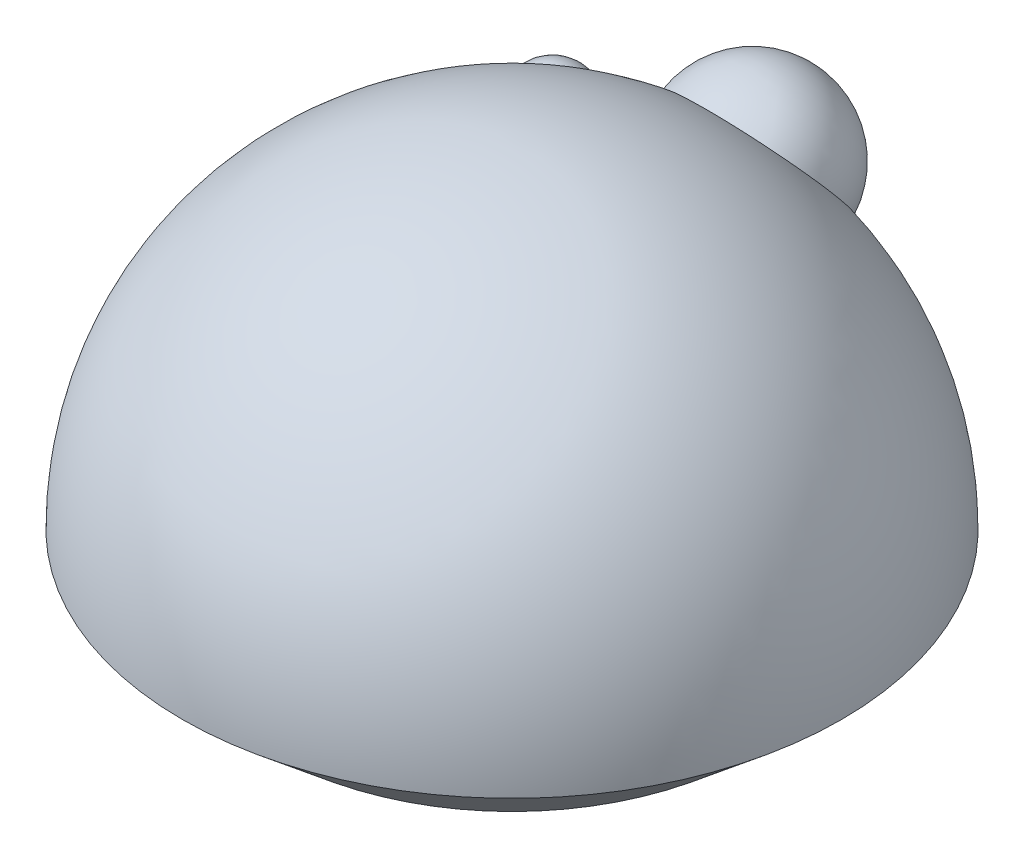
ISO-10303-21;
HEADER;
FILE_DESCRIPTION(('STEP AP214'),'2;1');
FILE_NAME('part.step','',(''),(''),'','','');
FILE_SCHEMA(('AUTOMOTIVE_DESIGN { 1 0 10303 214 1 1 1 1 }'));
ENDSEC;
DATA;
#1=APPLICATION_CONTEXT('core data for automotive mechanical design processes');
#2=APPLICATION_PROTOCOL_DEFINITION('international standard','automotive_design',2000,#1);
#3=PRODUCT_CONTEXT('',#1,'mechanical');
#4=PRODUCT('Part','Part','',(#3));
#5=PRODUCT_RELATED_PRODUCT_CATEGORY('part','',(#4));
#6=PRODUCT_DEFINITION_FORMATION('','',#4);
#7=PRODUCT_DEFINITION_CONTEXT('part definition',#1,'design');
#8=PRODUCT_DEFINITION('design','',#6,#7);
#9=PRODUCT_DEFINITION_SHAPE('','',#8);
#10=(LENGTH_UNIT() NAMED_UNIT(*) SI_UNIT(.MILLI.,.METRE.));
#11=(NAMED_UNIT(*) PLANE_ANGLE_UNIT() SI_UNIT($,.RADIAN.));
#12=(NAMED_UNIT(*) SI_UNIT($,.STERADIAN.) SOLID_ANGLE_UNIT());
#13=UNCERTAINTY_MEASURE_WITH_UNIT(LENGTH_MEASURE(1.E-05),#10,'distance_accuracy_value','');
#14=(GEOMETRIC_REPRESENTATION_CONTEXT(3) GLOBAL_UNCERTAINTY_ASSIGNED_CONTEXT((#13)) GLOBAL_UNIT_ASSIGNED_CONTEXT((#10,
#11,#12)) REPRESENTATION_CONTEXT('',''));
#15=CARTESIAN_POINT('',(0.,0.,0.));
#16=DIRECTION('',(0.,0.,1.));
#17=DIRECTION('',(1.,0.,0.));
#18=AXIS2_PLACEMENT_3D('',#15,#16,#17);
#19=CARTESIAN_POINT('',(0.,129.232052778404,0.));
#20=DIRECTION('',(0.,1.,0.));
#21=DIRECTION('',(1.,0.,0.));
#22=AXIS2_PLACEMENT_3D('',#19,#20,#21);
#23=SPHERICAL_SURFACE('',#22,75.);
#24=CARTESIAN_POINT('',(0.,175.508636051353,-56.0737410143181));
#25=DIRECTION('',(0.,0.636511821434824,-0.771266945469416));
#26=DIRECTION('',(0.,0.771266945469416,0.636511821434824));
#27=AXIS2_PLACEMENT_3D('',#24,#25,#26);
#28=CIRCLE('',#27,18.4177471271879);
#29=CARTESIAN_POINT('',(0.,189.713635620567,-44.3506272436657));
#30=VERTEX_POINT('',#29);
#31=EDGE_CURVE('E42',#30,#30,#28,.F.);
#32=ORIENTED_EDGE('',*,*,#31,.T.);
#33=EDGE_LOOP('',(#32));
#34=FACE_BOUND('',#33,.T.);
#35=CARTESIAN_POINT('',(0.,129.232052778404,0.));
#36=DIRECTION('',(0.,1.,0.));
#37=DIRECTION('',(0.,0.,1.));
#38=AXIS2_PLACEMENT_3D('',#35,#36,#37);
#39=CIRCLE('',#38,75.);
#40=CARTESIAN_POINT('',(0.,129.232052778404,75.));
#41=VERTEX_POINT('',#40);
#42=EDGE_CURVE('E10',#41,#41,#39,.T.);
#43=ORIENTED_EDGE('',*,*,#42,.T.);
#44=EDGE_LOOP('',(#43));
#45=FACE_BOUND('',#44,.T.);
#46=CARTESIAN_POINT('',(-44.1879325612681,157.769587064264,-52.7400854962121));
#47=DIRECTION('',(0.593221163318381,-0.38311521508329,0.708033462036133));
#48=DIRECTION('',(0.766518382271403,0.,-0.642222367751257));
#49=AXIS2_PLACEMENT_3D('',#46,#47,#48);
#50=CIRCLE('',#49,8.74752163166317);
#51=CARTESIAN_POINT('',(-37.4827964312815,157.769587064264,-58.3579395504542));
#52=VERTEX_POINT('',#51);
#53=EDGE_CURVE('E38',#52,#52,#50,.T.);
#54=ORIENTED_EDGE('',*,*,#53,.T.);
#55=EDGE_LOOP('',(#54));
#56=FACE_BOUND('',#55,.T.);
#57=ADVANCED_FACE('F35',(#34,#45,#56),#23,.T.);
#58=CARTESIAN_POINT('',(0.,129.232052778404,0.));
#59=DIRECTION('',(0.,1.,0.));
#60=DIRECTION('',(0.,0.,1.));
#61=AXIS2_PLACEMENT_3D('',#58,#59,#60);
#62=CONICAL_SURFACE('',#61,75.,0.874490454794038);
#63=CARTESIAN_POINT('',(0.,112.346574429716,0.));
#64=DIRECTION('',(0.,-1.,0.));
#65=DIRECTION('',(0.,0.,-1.));
#66=AXIS2_PLACEMENT_3D('',#63,#64,#65);
#67=CIRCLE('',#66,54.801890605236);
#68=CARTESIAN_POINT('',(0.,112.346574429716,-54.801890605236));
#69=VERTEX_POINT('',#68);
#70=EDGE_CURVE('E51',#69,#69,#67,.F.);
#71=ORIENTED_EDGE('',*,*,#70,.T.);
#72=EDGE_LOOP('',(#71));
#73=FACE_BOUND('',#72,.T.);
#74=ORIENTED_EDGE('',*,*,#42,.F.);
#75=EDGE_LOOP('',(#74));
#76=FACE_BOUND('',#75,.T.);
#77=ADVANCED_FACE('F55',(#73,#76),#62,.T.);
#78=CARTESIAN_POINT('',(0.,174.399462240071,-54.7297453985038));
#79=DIRECTION('',(0.,0.,1.));
#80=DIRECTION('',(0.,1.,0.));
#81=AXIS2_PLACEMENT_3D('',#78,#79,#80);
#82=SPHERICAL_SURFACE('',#81,18.5);
#83=CARTESIAN_POINT('',(0.,174.399462240071,-54.7297453985038));
#84=DIRECTION('',(0.,0.636511821434824,-0.771266945469416));
#85=DIRECTION('',(0.,0.771266945469416,0.636511821434824));
#86=AXIS2_PLACEMENT_3D('',#83,#84,#85);
#87=SPHERICAL_SURFACE('',#86,18.5);
#88=ORIENTED_EDGE('',*,*,#31,.F.);
#89=EDGE_LOOP('',(#88));
#90=FACE_BOUND('',#89,.T.);
#91=ADVANCED_FACE('F73',(#90),#87,.T.);
#92=CARTESIAN_POINT('',(0.,129.232052778404,0.));
#93=DIRECTION('',(0.593221163318381,-0.38311521508329,0.708033462036133));
#94=DIRECTION('',(0.766518382271403,0.,-0.642222367751257));
#95=AXIS2_PLACEMENT_3D('',#92,#93,#94);
#96=CYLINDRICAL_SURFACE('',#95,8.74752163166317);
#97=ORIENTED_EDGE('',*,*,#53,.F.);
#98=EDGE_LOOP('',(#97));
#99=FACE_BOUND('',#98,.T.);
#100=CARTESIAN_POINT('',(-47.4982914216726,159.907489292351,-56.6911327437566));
#101=DIRECTION('',(0.593221163318381,-0.38311521508329,0.708033462036133));
#102=DIRECTION('',(0.766518382271403,0.,-0.642222367751257));
#103=AXIS2_PLACEMENT_3D('',#100,#101,#102);
#104=CIRCLE('',#103,8.74752163166318);
#105=CARTESIAN_POINT('',(-40.7931552916861,159.907489292351,-62.3089867979987));
#106=VERTEX_POINT('',#105);
#107=EDGE_CURVE('E48',#106,#106,#104,.T.);
#108=ORIENTED_EDGE('',*,*,#107,.T.);
#109=EDGE_LOOP('',(#108));
#110=FACE_BOUND('',#109,.T.);
#111=ADVANCED_FACE('F65',(#99,#110),#96,.T.);
#112=CARTESIAN_POINT('',(-47.4982914216726,159.907489292351,-56.6911327437566));
#113=DIRECTION('',(0.593221163318381,-0.38311521508329,0.708033462036133));
#114=DIRECTION('',(0.246045160552322,0.923700564020443,0.293664854889204));
#115=AXIS2_PLACEMENT_3D('',#112,#113,#114);
#116=SPHERICAL_SURFACE('',#115,8.74752163166319);
#117=ORIENTED_EDGE('',*,*,#107,.F.);
#118=EDGE_LOOP('',(#117));
#119=FACE_BOUND('',#118,.T.);
#120=ADVANCED_FACE('F60',(#119),#116,.T.);
#121=CARTESIAN_POINT('',(0.,0.,0.));
#122=DIRECTION('',(0.,1.,0.));
#123=DIRECTION('',(1.,0.,0.));
#124=AXIS2_PLACEMENT_3D('',#121,#122,#123);
#125=SPHERICAL_SURFACE('',#124,125.);
#126=ORIENTED_EDGE('',*,*,#70,.F.);
#127=EDGE_LOOP('',(#126));
#128=FACE_BOUND('',#127,.T.);
#129=ADVANCED_FACE('F58',(#128),#125,.F.);
#130=CLOSED_SHELL('',(#57,#77,#91,#111,#120,#129));
#131=MANIFOLD_SOLID_BREP('B2',#130);
#132=ADVANCED_BREP_SHAPE_REPRESENTATION('',(#18,#131),#14);
#133=SHAPE_DEFINITION_REPRESENTATION(#9,#132);
ENDSEC;
END-ISO-10303-21;
